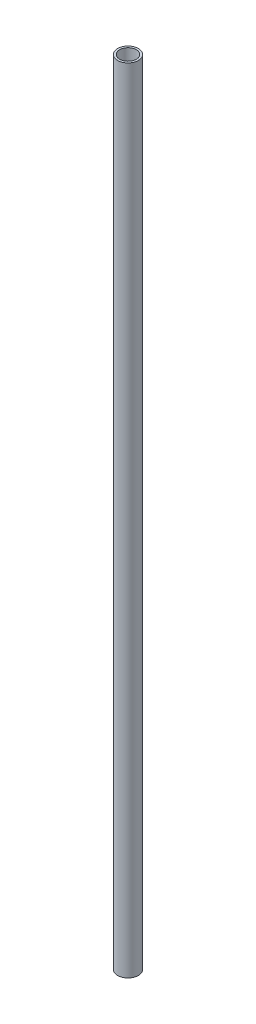
ISO-10303-21;
HEADER;
FILE_DESCRIPTION(('STEP AP214'),'2;1');
FILE_NAME('part.step','',(''),(''),'','','');
FILE_SCHEMA(('AUTOMOTIVE_DESIGN { 1 0 10303 214 1 1 1 1 }'));
ENDSEC;
DATA;
#1=APPLICATION_CONTEXT('core data for automotive mechanical design processes');
#2=APPLICATION_PROTOCOL_DEFINITION('international standard','automotive_design',2000,#1);
#3=PRODUCT_CONTEXT('',#1,'mechanical');
#4=PRODUCT('Part','Part','',(#3));
#5=PRODUCT_RELATED_PRODUCT_CATEGORY('part','',(#4));
#6=PRODUCT_DEFINITION_FORMATION('','',#4);
#7=PRODUCT_DEFINITION_CONTEXT('part definition',#1,'design');
#8=PRODUCT_DEFINITION('design','',#6,#7);
#9=PRODUCT_DEFINITION_SHAPE('','',#8);
#10=(LENGTH_UNIT() NAMED_UNIT(*) SI_UNIT(.MILLI.,.METRE.));
#11=(NAMED_UNIT(*) PLANE_ANGLE_UNIT() SI_UNIT($,.RADIAN.));
#12=(NAMED_UNIT(*) SI_UNIT($,.STERADIAN.) SOLID_ANGLE_UNIT());
#13=UNCERTAINTY_MEASURE_WITH_UNIT(LENGTH_MEASURE(1.E-05),#10,'distance_accuracy_value','');
#14=(GEOMETRIC_REPRESENTATION_CONTEXT(3) GLOBAL_UNCERTAINTY_ASSIGNED_CONTEXT((#13)) GLOBAL_UNIT_ASSIGNED_CONTEXT((#10,
#11,#12)) REPRESENTATION_CONTEXT('',''));
#15=CARTESIAN_POINT('',(0.,0.,0.));
#16=DIRECTION('',(0.,0.,1.));
#17=DIRECTION('',(1.,0.,0.));
#18=AXIS2_PLACEMENT_3D('',#15,#16,#17);
#19=CARTESIAN_POINT('',(0.,763.,0.));
#20=DIRECTION('',(0.,1.,0.));
#21=DIRECTION('',(0.,0.,1.));
#22=AXIS2_PLACEMENT_3D('',#19,#20,#21);
#23=PLANE('',#22);
#24=CARTESIAN_POINT('',(0.,763.,0.));
#25=DIRECTION('',(0.,1.,0.));
#26=DIRECTION('',(0.,0.,1.));
#27=AXIS2_PLACEMENT_3D('',#24,#25,#26);
#28=CIRCLE('',#27,10.);
#29=CARTESIAN_POINT('',(0.,763.,10.));
#30=VERTEX_POINT('',#29);
#31=EDGE_CURVE('E10',#30,#30,#28,.T.);
#32=ORIENTED_EDGE('',*,*,#31,.T.);
#33=EDGE_LOOP('',(#32));
#34=FACE_BOUND('',#33,.T.);
#35=CARTESIAN_POINT('',(0.,763.,0.));
#36=DIRECTION('',(0.,1.,0.));
#37=DIRECTION('',(0.,0.,1.));
#38=AXIS2_PLACEMENT_3D('',#35,#36,#37);
#39=CIRCLE('',#38,8.);
#40=CARTESIAN_POINT('',(0.,763.,8.));
#41=VERTEX_POINT('',#40);
#42=EDGE_CURVE('E46',#41,#41,#39,.T.);
#43=ORIENTED_EDGE('',*,*,#42,.F.);
#44=EDGE_LOOP('',(#43));
#45=FACE_BOUND('',#44,.T.);
#46=ADVANCED_FACE('F35',(#34,#45),#23,.T.);
#47=CARTESIAN_POINT('',(0.,0.,0.));
#48=DIRECTION('',(0.,1.,0.));
#49=DIRECTION('',(0.,0.,1.));
#50=AXIS2_PLACEMENT_3D('',#47,#48,#49);
#51=PLANE('',#50);
#52=CARTESIAN_POINT('',(0.,0.,0.));
#53=DIRECTION('',(0.,1.,0.));
#54=DIRECTION('',(0.,0.,1.));
#55=AXIS2_PLACEMENT_3D('',#52,#53,#54);
#56=CIRCLE('',#55,10.);
#57=CARTESIAN_POINT('',(0.,0.,10.));
#58=VERTEX_POINT('',#57);
#59=EDGE_CURVE('E39',#58,#58,#56,.T.);
#60=ORIENTED_EDGE('',*,*,#59,.F.);
#61=EDGE_LOOP('',(#60));
#62=FACE_BOUND('',#61,.T.);
#63=CARTESIAN_POINT('',(0.,0.,0.));
#64=DIRECTION('',(0.,1.,0.));
#65=DIRECTION('',(0.,0.,1.));
#66=AXIS2_PLACEMENT_3D('',#63,#64,#65);
#67=CIRCLE('',#66,8.);
#68=CARTESIAN_POINT('',(0.,0.,8.));
#69=VERTEX_POINT('',#68);
#70=EDGE_CURVE('E48',#69,#69,#67,.T.);
#71=ORIENTED_EDGE('',*,*,#70,.T.);
#72=EDGE_LOOP('',(#71));
#73=FACE_BOUND('',#72,.T.);
#74=ADVANCED_FACE('F58',(#62,#73),#51,.F.);
#75=CARTESIAN_POINT('',(0.,763.,0.));
#76=DIRECTION('',(0.,-1.,0.));
#77=DIRECTION('',(0.,0.,-1.));
#78=AXIS2_PLACEMENT_3D('',#75,#76,#77);
#79=CYLINDRICAL_SURFACE('',#78,10.);
#80=ORIENTED_EDGE('',*,*,#31,.F.);
#81=EDGE_LOOP('',(#80));
#82=FACE_BOUND('',#81,.T.);
#83=ORIENTED_EDGE('',*,*,#59,.T.);
#84=EDGE_LOOP('',(#83));
#85=FACE_BOUND('',#84,.T.);
#86=ADVANCED_FACE('F37',(#82,#85),#79,.T.);
#87=CARTESIAN_POINT('',(0.,763.,0.));
#88=DIRECTION('',(0.,-1.,0.));
#89=DIRECTION('',(0.,0.,-1.));
#90=AXIS2_PLACEMENT_3D('',#87,#88,#89);
#91=CYLINDRICAL_SURFACE('',#90,8.);
#92=ORIENTED_EDGE('',*,*,#42,.T.);
#93=EDGE_LOOP('',(#92));
#94=FACE_BOUND('',#93,.T.);
#95=ORIENTED_EDGE('',*,*,#70,.F.);
#96=EDGE_LOOP('',(#95));
#97=FACE_BOUND('',#96,.T.);
#98=ADVANCED_FACE('F54',(#94,#97),#91,.F.);
#99=CLOSED_SHELL('',(#46,#74,#86,#98));
#100=MANIFOLD_SOLID_BREP('B2',#99);
#101=ADVANCED_BREP_SHAPE_REPRESENTATION('',(#18,#100),#14);
#102=SHAPE_DEFINITION_REPRESENTATION(#9,#101);
ENDSEC;
END-ISO-10303-21;
